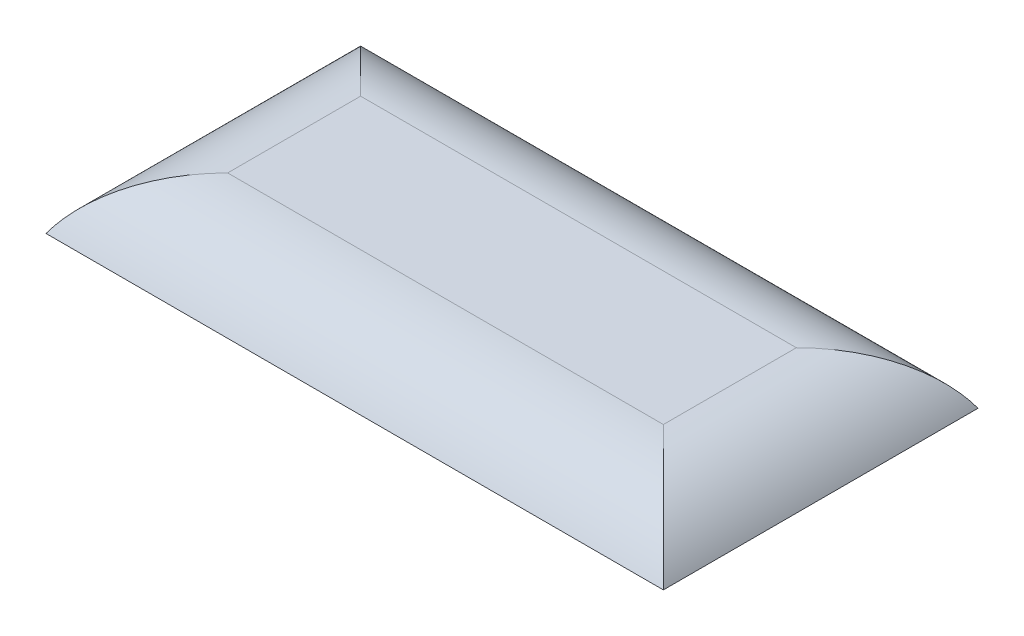
ISO-10303-21;
HEADER;
FILE_DESCRIPTION(('STEP AP214'),'2;1');
FILE_NAME('part.step','',(''),(''),'','','');
FILE_SCHEMA(('AUTOMOTIVE_DESIGN { 1 0 10303 214 1 1 1 1 }'));
ENDSEC;
DATA;
#1=APPLICATION_CONTEXT('core data for automotive mechanical design processes');
#2=APPLICATION_PROTOCOL_DEFINITION('international standard','automotive_design',2000,#1);
#3=PRODUCT_CONTEXT('',#1,'mechanical');
#4=PRODUCT('Part','Part','',(#3));
#5=PRODUCT_RELATED_PRODUCT_CATEGORY('part','',(#4));
#6=PRODUCT_DEFINITION_FORMATION('','',#4);
#7=PRODUCT_DEFINITION_CONTEXT('part definition',#1,'design');
#8=PRODUCT_DEFINITION('design','',#6,#7);
#9=PRODUCT_DEFINITION_SHAPE('','',#8);
#10=(LENGTH_UNIT() NAMED_UNIT(*) SI_UNIT(.MILLI.,.METRE.));
#11=(NAMED_UNIT(*) PLANE_ANGLE_UNIT() SI_UNIT($,.RADIAN.));
#12=(NAMED_UNIT(*) SI_UNIT($,.STERADIAN.) SOLID_ANGLE_UNIT());
#13=UNCERTAINTY_MEASURE_WITH_UNIT(LENGTH_MEASURE(1.E-05),#10,'distance_accuracy_value','');
#14=(GEOMETRIC_REPRESENTATION_CONTEXT(3) GLOBAL_UNCERTAINTY_ASSIGNED_CONTEXT((#13)) GLOBAL_UNIT_ASSIGNED_CONTEXT((#10,
#11,#12)) REPRESENTATION_CONTEXT('',''));
#15=CARTESIAN_POINT('',(0.,0.,0.));
#16=DIRECTION('',(0.,0.,1.));
#17=DIRECTION('',(1.,0.,0.));
#18=AXIS2_PLACEMENT_3D('',#15,#16,#17);
#19=CARTESIAN_POINT('',(-45.6140540935053,5.,28.3276476587275));
#20=DIRECTION('',(0.,1.,0.));
#21=DIRECTION('',(0.,0.,1.));
#22=AXIS2_PLACEMENT_3D('',#19,#20,#21);
#23=PLANE('',#22);
#24=DIRECTION('',(-1.,0.,0.));
#25=VECTOR('',#24,1.);
#26=CARTESIAN_POINT('',(13.2559459064947,5.,19.6673936208831));
#27=LINE('',#26,#25);
#28=CARTESIAN_POINT('',(-35.6140540935053,5.,19.6673936208831));
#29=VERTEX_POINT('',#28);
#30=CARTESIAN_POINT('',(4.59569186865033,5.,19.6673936208831));
#31=VERTEX_POINT('',#30);
#32=EDGE_CURVE('E51',#29,#31,#27,.F.);
#33=ORIENTED_EDGE('',*,*,#32,.T.);
#34=DIRECTION('',(0.,0.,1.));
#35=VECTOR('',#34,1.);
#36=CARTESIAN_POINT('',(4.59569186865033,5.,-1.67235234127247));
#37=LINE('',#36,#35);
#38=CARTESIAN_POINT('',(4.59569186865034,5.,18.3276476587275));
#39=VERTEX_POINT('',#38);
#40=EDGE_CURVE('E11',#31,#39,#37,.F.);
#41=ORIENTED_EDGE('',*,*,#40,.T.);
#42=DIRECTION('',(0.,0.,1.));
#43=VECTOR('',#42,1.);
#44=CARTESIAN_POINT('',(4.59569186865033,5.,-1.67235234127247));
#45=LINE('',#44,#43);
#46=CARTESIAN_POINT('',(4.59569186865034,5.,6.98790169657192));
#47=VERTEX_POINT('',#46);
#48=EDGE_CURVE('E40',#39,#47,#45,.F.);
#49=ORIENTED_EDGE('',*,*,#48,.T.);
#50=DIRECTION('',(1.,0.,0.));
#51=VECTOR('',#50,1.);
#52=CARTESIAN_POINT('',(-45.6140540935053,5.,6.98790169657192));
#53=LINE('',#52,#51);
#54=CARTESIAN_POINT('',(3.25594590649472,5.,6.98790169657192));
#55=VERTEX_POINT('',#54);
#56=EDGE_CURVE('E117',#47,#55,#53,.F.);
#57=ORIENTED_EDGE('',*,*,#56,.T.);
#58=DIRECTION('',(1.,0.,0.));
#59=VECTOR('',#58,1.);
#60=CARTESIAN_POINT('',(-45.6140540935053,5.,6.98790169657192));
#61=LINE('',#60,#59);
#62=CARTESIAN_POINT('',(-35.6140540935053,5.,6.98790169657192));
#63=VERTEX_POINT('',#62);
#64=EDGE_CURVE('E115',#55,#63,#61,.F.);
#65=ORIENTED_EDGE('',*,*,#64,.T.);
#66=DIRECTION('',(1.,0.,0.));
#67=VECTOR('',#66,1.);
#68=CARTESIAN_POINT('',(-45.6140540935053,5.,6.98790169657192));
#69=LINE('',#68,#67);
#70=CARTESIAN_POINT('',(-36.9538000556609,5.,6.98790169657192));
#71=VERTEX_POINT('',#70);
#72=EDGE_CURVE('E113',#63,#71,#69,.F.);
#73=ORIENTED_EDGE('',*,*,#72,.T.);
#74=DIRECTION('',(0.,0.,-1.));
#75=VECTOR('',#74,1.);
#76=CARTESIAN_POINT('',(-36.9538000556609,5.,28.3276476587275));
#77=LINE('',#76,#75);
#78=CARTESIAN_POINT('',(-36.9538000556609,5.,19.6673936208831));
#79=VERTEX_POINT('',#78);
#80=EDGE_CURVE('E110',#71,#79,#77,.F.);
#81=ORIENTED_EDGE('',*,*,#80,.T.);
#82=DIRECTION('',(-1.,0.,0.));
#83=VECTOR('',#82,1.);
#84=CARTESIAN_POINT('',(13.2559459064947,5.,19.6673936208831));
#85=LINE('',#84,#83);
#86=EDGE_CURVE('E97',#79,#29,#85,.F.);
#87=ORIENTED_EDGE('',*,*,#86,.T.);
#88=EDGE_LOOP('',(#33,#41,#49,#57,#65,#73,#81,#87));
#89=FACE_BOUND('',#88,.T.);
#90=ADVANCED_FACE('F31',(#89),#23,.T.);
#91=CARTESIAN_POINT('',(-45.6140540935053,0.,28.3276476587275));
#92=DIRECTION('',(0.,1.,0.));
#93=DIRECTION('',(0.,0.,1.));
#94=AXIS2_PLACEMENT_3D('',#91,#92,#93);
#95=PLANE('',#94);
#96=DIRECTION('',(0.,0.,1.));
#97=VECTOR('',#96,1.);
#98=CARTESIAN_POINT('',(-45.6140540935053,0.,-1.67235234127247));
#99=LINE('',#98,#97);
#100=CARTESIAN_POINT('',(-45.6140540935053,0.,-1.67235234127247));
#101=VERTEX_POINT('',#100);
#102=CARTESIAN_POINT('',(-45.6140540935053,0.,28.3276476587275));
#103=VERTEX_POINT('',#102);
#104=EDGE_CURVE('E87',#101,#103,#99,.T.);
#105=ORIENTED_EDGE('',*,*,#104,.F.);
#106=DIRECTION('',(-1.,0.,0.));
#107=VECTOR('',#106,1.);
#108=CARTESIAN_POINT('',(-45.6140540935053,0.,-1.67235234127247));
#109=LINE('',#108,#107);
#110=CARTESIAN_POINT('',(13.2559459064947,0.,-1.67235234127247));
#111=VERTEX_POINT('',#110);
#112=EDGE_CURVE('E108',#111,#101,#109,.T.);
#113=ORIENTED_EDGE('',*,*,#112,.F.);
#114=DIRECTION('',(0.,0.,-1.));
#115=VECTOR('',#114,1.);
#116=CARTESIAN_POINT('',(13.2559459064947,0.,-1.67235234127247));
#117=LINE('',#116,#115);
#118=CARTESIAN_POINT('',(13.2559459064947,0.,28.3276476587275));
#119=VERTEX_POINT('',#118);
#120=EDGE_CURVE('E90',#119,#111,#117,.T.);
#121=ORIENTED_EDGE('',*,*,#120,.F.);
#122=DIRECTION('',(1.,0.,0.));
#123=VECTOR('',#122,1.);
#124=CARTESIAN_POINT('',(-45.6140540935053,0.,28.3276476587275));
#125=LINE('',#124,#123);
#126=EDGE_CURVE('E82',#103,#119,#125,.T.);
#127=ORIENTED_EDGE('',*,*,#126,.F.);
#128=EDGE_LOOP('',(#105,#113,#121,#127));
#129=FACE_BOUND('',#128,.T.);
#130=ADVANCED_FACE('F84',(#129),#95,.F.);
#131=CARTESIAN_POINT('',(-45.6140540935053,-5.,19.6673936208831));
#132=DIRECTION('',(1.,0.,0.));
#133=DIRECTION('',(0.,0.,-1.));
#134=AXIS2_PLACEMENT_3D('',#131,#132,#133);
#135=CYLINDRICAL_SURFACE('',#134,10.);
#136=CARTESIAN_POINT('',(-36.9538000556609,-5.,19.6673936208831));
#137=DIRECTION('',(0.707106781186547,0.,0.707106781186547));
#138=DIRECTION('',(-0.707106781186547,0.,0.707106781186547));
#139=AXIS2_PLACEMENT_3D('',#136,#137,#138);
#140=ELLIPSE('',#139,14.1421356237309,10.);
#141=EDGE_CURVE('E96',#103,#79,#140,.F.);
#142=ORIENTED_EDGE('',*,*,#141,.F.);
#143=ORIENTED_EDGE('',*,*,#126,.T.);
#144=CARTESIAN_POINT('',(4.59569186865033,-5.,19.6673936208831));
#145=DIRECTION('',(0.707106781186547,0.,-0.707106781186548));
#146=DIRECTION('',(0.707106781186548,0.,0.707106781186547));
#147=AXIS2_PLACEMENT_3D('',#144,#145,#146);
#148=ELLIPSE('',#147,14.142135623731,10.);
#149=EDGE_CURVE('E35',#31,#119,#148,.T.);
#150=ORIENTED_EDGE('',*,*,#149,.F.);
#151=ORIENTED_EDGE('',*,*,#32,.F.);
#152=ORIENTED_EDGE('',*,*,#86,.F.);
#153=EDGE_LOOP('',(#142,#143,#150,#151,#152));
#154=FACE_BOUND('',#153,.T.);
#155=ADVANCED_FACE('F33',(#154),#135,.T.);
#156=CARTESIAN_POINT('',(4.59569186865033,-5.,-1.67235234127247));
#157=DIRECTION('',(0.,0.,-1.));
#158=DIRECTION('',(-1.,0.,0.));
#159=AXIS2_PLACEMENT_3D('',#156,#157,#158);
#160=CYLINDRICAL_SURFACE('',#159,10.);
#161=ORIENTED_EDGE('',*,*,#149,.T.);
#162=ORIENTED_EDGE('',*,*,#120,.T.);
#163=CARTESIAN_POINT('',(4.59569186865034,-5.,6.98790169657192));
#164=DIRECTION('',(-0.707106781186548,0.,-0.707106781186547));
#165=DIRECTION('',(0.707106781186547,0.,-0.707106781186548));
#166=AXIS2_PLACEMENT_3D('',#163,#164,#165);
#167=ELLIPSE('',#166,14.1421356237309,10.);
#168=EDGE_CURVE('E100',#47,#111,#167,.T.);
#169=ORIENTED_EDGE('',*,*,#168,.F.);
#170=ORIENTED_EDGE('',*,*,#48,.F.);
#171=ORIENTED_EDGE('',*,*,#40,.F.);
#172=EDGE_LOOP('',(#161,#162,#169,#170,#171));
#173=FACE_BOUND('',#172,.T.);
#174=ADVANCED_FACE('F128',(#173),#160,.T.);
#175=CARTESIAN_POINT('',(-36.9538000556609,-5.,-1.67235234127247));
#176=DIRECTION('',(0.,0.,1.));
#177=DIRECTION('',(1.,0.,0.));
#178=AXIS2_PLACEMENT_3D('',#175,#176,#177);
#179=CYLINDRICAL_SURFACE('',#178,10.);
#180=ORIENTED_EDGE('',*,*,#141,.T.);
#181=ORIENTED_EDGE('',*,*,#80,.F.);
#182=CARTESIAN_POINT('',(-36.9538000556609,-5.,6.98790169657192));
#183=DIRECTION('',(-0.707106781186547,0.,0.707106781186547));
#184=DIRECTION('',(0.707106781186547,0.,0.707106781186547));
#185=AXIS2_PLACEMENT_3D('',#182,#183,#184);
#186=ELLIPSE('',#185,14.1421356237309,10.);
#187=EDGE_CURVE('E104',#101,#71,#186,.F.);
#188=ORIENTED_EDGE('',*,*,#187,.F.);
#189=ORIENTED_EDGE('',*,*,#104,.T.);
#190=EDGE_LOOP('',(#180,#181,#188,#189));
#191=FACE_BOUND('',#190,.T.);
#192=ADVANCED_FACE('F102',(#191),#179,.T.);
#193=CARTESIAN_POINT('',(-45.6140540935053,-5.,6.98790169657192));
#194=DIRECTION('',(-1.,0.,0.));
#195=DIRECTION('',(0.,0.,1.));
#196=AXIS2_PLACEMENT_3D('',#193,#194,#195);
#197=CYLINDRICAL_SURFACE('',#196,10.);
#198=ORIENTED_EDGE('',*,*,#168,.T.);
#199=ORIENTED_EDGE('',*,*,#112,.T.);
#200=ORIENTED_EDGE('',*,*,#187,.T.);
#201=ORIENTED_EDGE('',*,*,#72,.F.);
#202=ORIENTED_EDGE('',*,*,#64,.F.);
#203=ORIENTED_EDGE('',*,*,#56,.F.);
#204=EDGE_LOOP('',(#198,#199,#200,#201,#202,#203));
#205=FACE_BOUND('',#204,.T.);
#206=ADVANCED_FACE('F126',(#205),#197,.T.);
#207=CLOSED_SHELL('',(#90,#130,#155,#174,#192,#206));
#208=MANIFOLD_SOLID_BREP('B2',#207);
#209=ADVANCED_BREP_SHAPE_REPRESENTATION('',(#18,#208),#14);
#210=SHAPE_DEFINITION_REPRESENTATION(#9,#209);
ENDSEC;
END-ISO-10303-21;
